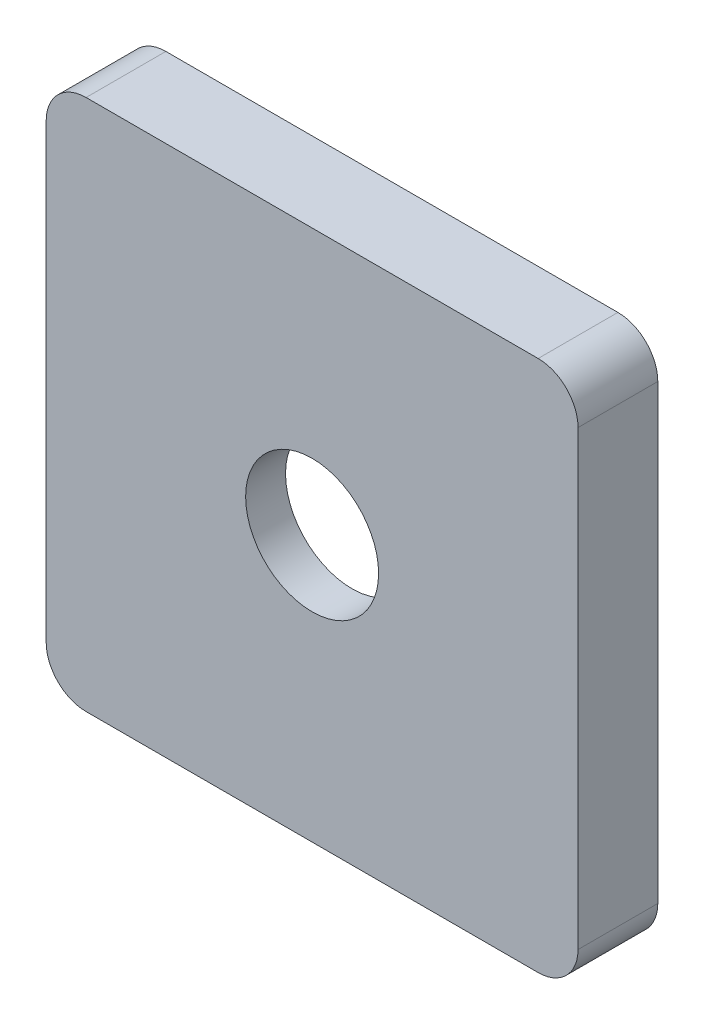
ISO-10303-21;
HEADER;
FILE_DESCRIPTION(('STEP AP214'),'2;1');
FILE_NAME('part.step','',(''),(''),'','','');
FILE_SCHEMA(('AUTOMOTIVE_DESIGN { 1 0 10303 214 1 1 1 1 }'));
ENDSEC;
DATA;
#1=APPLICATION_CONTEXT('core data for automotive mechanical design processes');
#2=APPLICATION_PROTOCOL_DEFINITION('international standard','automotive_design',2000,#1);
#3=PRODUCT_CONTEXT('',#1,'mechanical');
#4=PRODUCT('Part','Part','',(#3));
#5=PRODUCT_RELATED_PRODUCT_CATEGORY('part','',(#4));
#6=PRODUCT_DEFINITION_FORMATION('','',#4);
#7=PRODUCT_DEFINITION_CONTEXT('part definition',#1,'design');
#8=PRODUCT_DEFINITION('design','',#6,#7);
#9=PRODUCT_DEFINITION_SHAPE('','',#8);
#10=(LENGTH_UNIT() NAMED_UNIT(*) SI_UNIT(.MILLI.,.METRE.));
#11=(NAMED_UNIT(*) PLANE_ANGLE_UNIT() SI_UNIT($,.RADIAN.));
#12=(NAMED_UNIT(*) SI_UNIT($,.STERADIAN.) SOLID_ANGLE_UNIT());
#13=UNCERTAINTY_MEASURE_WITH_UNIT(LENGTH_MEASURE(1.E-05),#10,'distance_accuracy_value','');
#14=(GEOMETRIC_REPRESENTATION_CONTEXT(3) GLOBAL_UNCERTAINTY_ASSIGNED_CONTEXT((#13)) GLOBAL_UNIT_ASSIGNED_CONTEXT((#10,
#11,#12)) REPRESENTATION_CONTEXT('',''));
#15=CARTESIAN_POINT('',(0.,0.,0.));
#16=DIRECTION('',(0.,0.,1.));
#17=DIRECTION('',(1.,0.,0.));
#18=AXIS2_PLACEMENT_3D('',#15,#16,#17);
#19=CARTESIAN_POINT('',(0.,0.,1.5));
#20=DIRECTION('',(0.,0.,-1.));
#21=DIRECTION('',(-1.,0.,0.));
#22=AXIS2_PLACEMENT_3D('',#19,#20,#21);
#23=CYLINDRICAL_SURFACE('',#22,2.5);
#24=CARTESIAN_POINT('',(0.,0.,1.5));
#25=DIRECTION('',(0.,0.,1.));
#26=DIRECTION('',(1.,0.,0.));
#27=AXIS2_PLACEMENT_3D('',#24,#25,#26);
#28=CIRCLE('',#27,2.5);
#29=CARTESIAN_POINT('',(2.5,0.,1.5));
#30=VERTEX_POINT('',#29);
#31=EDGE_CURVE('E136',#30,#30,#28,.T.);
#32=ORIENTED_EDGE('',*,*,#31,.T.);
#33=EDGE_LOOP('',(#32));
#34=FACE_BOUND('',#33,.T.);
#35=CARTESIAN_POINT('',(0.,0.,0.));
#36=DIRECTION('',(0.,0.,-1.));
#37=DIRECTION('',(-1.,0.,0.));
#38=AXIS2_PLACEMENT_3D('',#35,#36,#37);
#39=CIRCLE('',#38,2.5);
#40=CARTESIAN_POINT('',(-2.5,0.,0.));
#41=VERTEX_POINT('',#40);
#42=EDGE_CURVE('E37',#41,#41,#39,.T.);
#43=ORIENTED_EDGE('',*,*,#42,.T.);
#44=EDGE_LOOP('',(#43));
#45=FACE_BOUND('',#44,.T.);
#46=ADVANCED_FACE('F33',(#34,#45),#23,.F.);
#47=CARTESIAN_POINT('',(-8.5,-8.5,1.5));
#48=DIRECTION('',(0.,0.,1.));
#49=DIRECTION('',(1.,0.,0.));
#50=AXIS2_PLACEMENT_3D('',#47,#48,#49);
#51=PLANE('',#50);
#52=CARTESIAN_POINT('',(-8.5,-8.5,1.5));
#53=DIRECTION('',(0.,0.,1.));
#54=DIRECTION('',(1.,0.,0.));
#55=AXIS2_PLACEMENT_3D('',#52,#53,#54);
#56=CIRCLE('',#55,1.5);
#57=CARTESIAN_POINT('',(-10.,-8.49999999999999,1.5));
#58=VERTEX_POINT('',#57);
#59=CARTESIAN_POINT('',(-8.49999999999999,-10.,1.5));
#60=VERTEX_POINT('',#59);
#61=EDGE_CURVE('E147',#58,#60,#56,.T.);
#62=ORIENTED_EDGE('',*,*,#61,.T.);
#63=DIRECTION('',(1.,0.,0.));
#64=VECTOR('',#63,1.);
#65=CARTESIAN_POINT('',(-8.49999999999999,-10.,1.5));
#66=LINE('',#65,#64);
#67=CARTESIAN_POINT('',(8.49999999999999,-10.,1.5));
#68=VERTEX_POINT('',#67);
#69=EDGE_CURVE('E94',#60,#68,#66,.T.);
#70=ORIENTED_EDGE('',*,*,#69,.T.);
#71=CARTESIAN_POINT('',(8.5,-8.5,1.5));
#72=DIRECTION('',(0.,0.,1.));
#73=DIRECTION('',(1.,0.,0.));
#74=AXIS2_PLACEMENT_3D('',#71,#72,#73);
#75=CIRCLE('',#74,1.5);
#76=CARTESIAN_POINT('',(10.,-8.49999999999999,1.5));
#77=VERTEX_POINT('',#76);
#78=EDGE_CURVE('E163',#68,#77,#75,.T.);
#79=ORIENTED_EDGE('',*,*,#78,.T.);
#80=DIRECTION('',(0.,1.,0.));
#81=VECTOR('',#80,1.);
#82=CARTESIAN_POINT('',(10.,8.49999999999999,1.5));
#83=LINE('',#82,#81);
#84=CARTESIAN_POINT('',(10.,8.49999999999999,1.5));
#85=VERTEX_POINT('',#84);
#86=EDGE_CURVE('E175',#77,#85,#83,.T.);
#87=ORIENTED_EDGE('',*,*,#86,.T.);
#88=CARTESIAN_POINT('',(8.5,8.5,1.5));
#89=DIRECTION('',(0.,0.,1.));
#90=DIRECTION('',(-1.,0.,0.));
#91=AXIS2_PLACEMENT_3D('',#88,#89,#90);
#92=CIRCLE('',#91,1.5);
#93=CARTESIAN_POINT('',(8.49999999999999,10.,1.5));
#94=VERTEX_POINT('',#93);
#95=EDGE_CURVE('E114',#85,#94,#92,.T.);
#96=ORIENTED_EDGE('',*,*,#95,.T.);
#97=DIRECTION('',(-1.,0.,0.));
#98=VECTOR('',#97,1.);
#99=CARTESIAN_POINT('',(-8.49999999999999,10.,1.5));
#100=LINE('',#99,#98);
#101=CARTESIAN_POINT('',(-8.49999999999999,10.,1.5));
#102=VERTEX_POINT('',#101);
#103=EDGE_CURVE('E107',#94,#102,#100,.T.);
#104=ORIENTED_EDGE('',*,*,#103,.T.);
#105=CARTESIAN_POINT('',(-8.5,8.5,1.5));
#106=DIRECTION('',(0.,0.,1.));
#107=DIRECTION('',(1.,0.,0.));
#108=AXIS2_PLACEMENT_3D('',#105,#106,#107);
#109=CIRCLE('',#108,1.5);
#110=CARTESIAN_POINT('',(-10.,8.49999999999999,1.5));
#111=VERTEX_POINT('',#110);
#112=EDGE_CURVE('E112',#102,#111,#109,.T.);
#113=ORIENTED_EDGE('',*,*,#112,.T.);
#114=DIRECTION('',(0.,-1.,0.));
#115=VECTOR('',#114,1.);
#116=CARTESIAN_POINT('',(-10.,8.49999999999999,1.5));
#117=LINE('',#116,#115);
#118=EDGE_CURVE('E51',#111,#58,#117,.T.);
#119=ORIENTED_EDGE('',*,*,#118,.T.);
#120=EDGE_LOOP('',(#62,#70,#79,#87,#96,#104,#113,#119));
#121=FACE_BOUND('',#120,.T.);
#122=ORIENTED_EDGE('',*,*,#31,.F.);
#123=EDGE_LOOP('',(#122));
#124=FACE_BOUND('',#123,.T.);
#125=ADVANCED_FACE('F109',(#121,#124),#51,.T.);
#126=CARTESIAN_POINT('',(-8.5,-8.5,-1.5));
#127=DIRECTION('',(0.,0.,1.));
#128=DIRECTION('',(1.,0.,0.));
#129=AXIS2_PLACEMENT_3D('',#126,#127,#128);
#130=PLANE('',#129);
#131=CARTESIAN_POINT('',(0.,0.,-1.5));
#132=DIRECTION('',(0.,0.,-1.));
#133=DIRECTION('',(-1.,0.,0.));
#134=AXIS2_PLACEMENT_3D('',#131,#132,#133);
#135=CIRCLE('',#134,5.);
#136=CARTESIAN_POINT('',(-5.,0.,-1.5));
#137=VERTEX_POINT('',#136);
#138=EDGE_CURVE('E183',#137,#137,#135,.T.);
#139=ORIENTED_EDGE('',*,*,#138,.F.);
#140=EDGE_LOOP('',(#139));
#141=FACE_BOUND('',#140,.T.);
#142=CARTESIAN_POINT('',(-8.5,-8.5,-1.5));
#143=DIRECTION('',(0.,0.,1.));
#144=DIRECTION('',(1.,0.,0.));
#145=AXIS2_PLACEMENT_3D('',#142,#143,#144);
#146=CIRCLE('',#145,1.5);
#147=CARTESIAN_POINT('',(-10.,-8.49999999999999,-1.5));
#148=VERTEX_POINT('',#147);
#149=CARTESIAN_POINT('',(-8.49999999999999,-10.,-1.5));
#150=VERTEX_POINT('',#149);
#151=EDGE_CURVE('E132',#148,#150,#146,.T.);
#152=ORIENTED_EDGE('',*,*,#151,.F.);
#153=DIRECTION('',(0.,-1.,0.));
#154=VECTOR('',#153,1.);
#155=CARTESIAN_POINT('',(-10.,8.49999999999999,-1.5));
#156=LINE('',#155,#154);
#157=CARTESIAN_POINT('',(-10.,8.49999999999999,-1.5));
#158=VERTEX_POINT('',#157);
#159=EDGE_CURVE('E86',#158,#148,#156,.T.);
#160=ORIENTED_EDGE('',*,*,#159,.F.);
#161=CARTESIAN_POINT('',(-8.5,8.5,-1.5));
#162=DIRECTION('',(0.,0.,1.));
#163=DIRECTION('',(1.,0.,0.));
#164=AXIS2_PLACEMENT_3D('',#161,#162,#163);
#165=CIRCLE('',#164,1.5);
#166=CARTESIAN_POINT('',(-8.49999999999999,10.,-1.5));
#167=VERTEX_POINT('',#166);
#168=EDGE_CURVE('E80',#167,#158,#165,.T.);
#169=ORIENTED_EDGE('',*,*,#168,.F.);
#170=DIRECTION('',(-1.,0.,0.));
#171=VECTOR('',#170,1.);
#172=CARTESIAN_POINT('',(-8.49999999999999,10.,-1.5));
#173=LINE('',#172,#171);
#174=CARTESIAN_POINT('',(8.49999999999999,10.,-1.5));
#175=VERTEX_POINT('',#174);
#176=EDGE_CURVE('E122',#175,#167,#173,.T.);
#177=ORIENTED_EDGE('',*,*,#176,.F.);
#178=CARTESIAN_POINT('',(8.5,8.5,-1.5));
#179=DIRECTION('',(0.,0.,1.));
#180=DIRECTION('',(-1.,0.,0.));
#181=AXIS2_PLACEMENT_3D('',#178,#179,#180);
#182=CIRCLE('',#181,1.5);
#183=CARTESIAN_POINT('',(10.,8.49999999999999,-1.5));
#184=VERTEX_POINT('',#183);
#185=EDGE_CURVE('E142',#184,#175,#182,.T.);
#186=ORIENTED_EDGE('',*,*,#185,.F.);
#187=DIRECTION('',(0.,1.,0.));
#188=VECTOR('',#187,1.);
#189=CARTESIAN_POINT('',(10.,8.49999999999999,-1.5));
#190=LINE('',#189,#188);
#191=CARTESIAN_POINT('',(10.,-8.49999999999999,-1.5));
#192=VERTEX_POINT('',#191);
#193=EDGE_CURVE('E140',#192,#184,#190,.T.);
#194=ORIENTED_EDGE('',*,*,#193,.F.);
#195=CARTESIAN_POINT('',(8.5,-8.5,-1.5));
#196=DIRECTION('',(0.,0.,1.));
#197=DIRECTION('',(1.,0.,0.));
#198=AXIS2_PLACEMENT_3D('',#195,#196,#197);
#199=CIRCLE('',#198,1.5);
#200=CARTESIAN_POINT('',(8.49999999999999,-10.,-1.5));
#201=VERTEX_POINT('',#200);
#202=EDGE_CURVE('E138',#201,#192,#199,.T.);
#203=ORIENTED_EDGE('',*,*,#202,.F.);
#204=DIRECTION('',(1.,0.,0.));
#205=VECTOR('',#204,1.);
#206=CARTESIAN_POINT('',(-8.49999999999999,-10.,-1.5));
#207=LINE('',#206,#205);
#208=EDGE_CURVE('E135',#150,#201,#207,.T.);
#209=ORIENTED_EDGE('',*,*,#208,.F.);
#210=EDGE_LOOP('',(#152,#160,#169,#177,#186,#194,#203,#209));
#211=FACE_BOUND('',#210,.T.);
#212=ADVANCED_FACE('F167',(#141,#211),#130,.F.);
#213=CARTESIAN_POINT('',(-8.5,-8.5,1.5));
#214=DIRECTION('',(0.,0.,-1.));
#215=DIRECTION('',(-1.,0.,0.));
#216=AXIS2_PLACEMENT_3D('',#213,#214,#215);
#217=CYLINDRICAL_SURFACE('',#216,1.5);
#218=ORIENTED_EDGE('',*,*,#151,.T.);
#219=DIRECTION('',(0.,0.,-1.));
#220=VECTOR('',#219,1.);
#221=CARTESIAN_POINT('',(-8.49999999999999,-10.,1.5));
#222=LINE('',#221,#220);
#223=EDGE_CURVE('E11',#60,#150,#222,.T.);
#224=ORIENTED_EDGE('',*,*,#223,.F.);
#225=ORIENTED_EDGE('',*,*,#61,.F.);
#226=DIRECTION('',(0.,0.,-1.));
#227=VECTOR('',#226,1.);
#228=CARTESIAN_POINT('',(-10.,-8.49999999999999,1.5));
#229=LINE('',#228,#227);
#230=EDGE_CURVE('E128',#58,#148,#229,.T.);
#231=ORIENTED_EDGE('',*,*,#230,.T.);
#232=EDGE_LOOP('',(#218,#224,#225,#231));
#233=FACE_BOUND('',#232,.T.);
#234=ADVANCED_FACE('F35',(#233),#217,.T.);
#235=CARTESIAN_POINT('',(-8.49999999999999,-10.,1.5));
#236=DIRECTION('',(0.,1.,0.));
#237=DIRECTION('',(0.,0.,1.));
#238=AXIS2_PLACEMENT_3D('',#235,#236,#237);
#239=PLANE('',#238);
#240=ORIENTED_EDGE('',*,*,#208,.T.);
#241=DIRECTION('',(0.,0.,-1.));
#242=VECTOR('',#241,1.);
#243=CARTESIAN_POINT('',(8.49999999999999,-10.,1.5));
#244=LINE('',#243,#242);
#245=EDGE_CURVE('E43',#68,#201,#244,.T.);
#246=ORIENTED_EDGE('',*,*,#245,.F.);
#247=ORIENTED_EDGE('',*,*,#69,.F.);
#248=ORIENTED_EDGE('',*,*,#223,.T.);
#249=EDGE_LOOP('',(#240,#246,#247,#248));
#250=FACE_BOUND('',#249,.T.);
#251=ADVANCED_FACE('F226',(#250),#239,.F.);
#252=CARTESIAN_POINT('',(8.5,-8.5,1.5));
#253=DIRECTION('',(0.,0.,-1.));
#254=DIRECTION('',(-1.,0.,0.));
#255=AXIS2_PLACEMENT_3D('',#252,#253,#254);
#256=CYLINDRICAL_SURFACE('',#255,1.5);
#257=ORIENTED_EDGE('',*,*,#202,.T.);
#258=DIRECTION('',(0.,0.,-1.));
#259=VECTOR('',#258,1.);
#260=CARTESIAN_POINT('',(10.,-8.49999999999999,1.5));
#261=LINE('',#260,#259);
#262=EDGE_CURVE('E154',#77,#192,#261,.T.);
#263=ORIENTED_EDGE('',*,*,#262,.F.);
#264=ORIENTED_EDGE('',*,*,#78,.F.);
#265=ORIENTED_EDGE('',*,*,#245,.T.);
#266=EDGE_LOOP('',(#257,#263,#264,#265));
#267=FACE_BOUND('',#266,.T.);
#268=ADVANCED_FACE('F161',(#267),#256,.T.);
#269=CARTESIAN_POINT('',(10.,8.49999999999999,1.5));
#270=DIRECTION('',(-1.,0.,0.));
#271=DIRECTION('',(0.,-1.,0.));
#272=AXIS2_PLACEMENT_3D('',#269,#270,#271);
#273=PLANE('',#272);
#274=ORIENTED_EDGE('',*,*,#193,.T.);
#275=DIRECTION('',(0.,0.,-1.));
#276=VECTOR('',#275,1.);
#277=CARTESIAN_POINT('',(10.,8.49999999999999,1.5));
#278=LINE('',#277,#276);
#279=EDGE_CURVE('E151',#85,#184,#278,.T.);
#280=ORIENTED_EDGE('',*,*,#279,.F.);
#281=ORIENTED_EDGE('',*,*,#86,.F.);
#282=ORIENTED_EDGE('',*,*,#262,.T.);
#283=EDGE_LOOP('',(#274,#280,#281,#282));
#284=FACE_BOUND('',#283,.T.);
#285=ADVANCED_FACE('F171',(#284),#273,.F.);
#286=CARTESIAN_POINT('',(8.5,8.5,1.5));
#287=DIRECTION('',(0.,0.,-1.));
#288=DIRECTION('',(-1.,0.,0.));
#289=AXIS2_PLACEMENT_3D('',#286,#287,#288);
#290=CYLINDRICAL_SURFACE('',#289,1.5);
#291=ORIENTED_EDGE('',*,*,#185,.T.);
#292=DIRECTION('',(0.,0.,-1.));
#293=VECTOR('',#292,1.);
#294=CARTESIAN_POINT('',(8.49999999999999,10.,1.5));
#295=LINE('',#294,#293);
#296=EDGE_CURVE('E123',#94,#175,#295,.T.);
#297=ORIENTED_EDGE('',*,*,#296,.F.);
#298=ORIENTED_EDGE('',*,*,#95,.F.);
#299=ORIENTED_EDGE('',*,*,#279,.T.);
#300=EDGE_LOOP('',(#291,#297,#298,#299));
#301=FACE_BOUND('',#300,.T.);
#302=ADVANCED_FACE('F174',(#301),#290,.T.);
#303=CARTESIAN_POINT('',(-8.49999999999999,10.,1.5));
#304=DIRECTION('',(0.,-1.,0.));
#305=DIRECTION('',(0.,0.,-1.));
#306=AXIS2_PLACEMENT_3D('',#303,#304,#305);
#307=PLANE('',#306);
#308=ORIENTED_EDGE('',*,*,#176,.T.);
#309=DIRECTION('',(0.,0.,-1.));
#310=VECTOR('',#309,1.);
#311=CARTESIAN_POINT('',(-8.49999999999999,10.,1.5));
#312=LINE('',#311,#310);
#313=EDGE_CURVE('E119',#102,#167,#312,.T.);
#314=ORIENTED_EDGE('',*,*,#313,.F.);
#315=ORIENTED_EDGE('',*,*,#103,.F.);
#316=ORIENTED_EDGE('',*,*,#296,.T.);
#317=EDGE_LOOP('',(#308,#314,#315,#316));
#318=FACE_BOUND('',#317,.T.);
#319=ADVANCED_FACE('F120',(#318),#307,.F.);
#320=CARTESIAN_POINT('',(-8.5,8.5,1.5));
#321=DIRECTION('',(0.,0.,-1.));
#322=DIRECTION('',(-1.,0.,0.));
#323=AXIS2_PLACEMENT_3D('',#320,#321,#322);
#324=CYLINDRICAL_SURFACE('',#323,1.5);
#325=ORIENTED_EDGE('',*,*,#168,.T.);
#326=DIRECTION('',(0.,0.,-1.));
#327=VECTOR('',#326,1.);
#328=CARTESIAN_POINT('',(-10.,8.49999999999999,1.5));
#329=LINE('',#328,#327);
#330=EDGE_CURVE('E124',#111,#158,#329,.T.);
#331=ORIENTED_EDGE('',*,*,#330,.F.);
#332=ORIENTED_EDGE('',*,*,#112,.F.);
#333=ORIENTED_EDGE('',*,*,#313,.T.);
#334=EDGE_LOOP('',(#325,#331,#332,#333));
#335=FACE_BOUND('',#334,.T.);
#336=ADVANCED_FACE('F126',(#335),#324,.T.);
#337=CARTESIAN_POINT('',(-10.,8.49999999999999,1.5));
#338=DIRECTION('',(1.,0.,0.));
#339=DIRECTION('',(0.,0.,-1.));
#340=AXIS2_PLACEMENT_3D('',#337,#338,#339);
#341=PLANE('',#340);
#342=ORIENTED_EDGE('',*,*,#159,.T.);
#343=ORIENTED_EDGE('',*,*,#230,.F.);
#344=ORIENTED_EDGE('',*,*,#118,.F.);
#345=ORIENTED_EDGE('',*,*,#330,.T.);
#346=EDGE_LOOP('',(#342,#343,#344,#345));
#347=FACE_BOUND('',#346,.T.);
#348=ADVANCED_FACE('F201',(#347),#341,.F.);
#349=CARTESIAN_POINT('',(0.,0.,0.));
#350=DIRECTION('',(0.,0.,-1.));
#351=DIRECTION('',(-1.,0.,0.));
#352=AXIS2_PLACEMENT_3D('',#349,#350,#351);
#353=CYLINDRICAL_SURFACE('',#352,5.);
#354=CARTESIAN_POINT('',(0.,0.,0.));
#355=DIRECTION('',(0.,0.,-1.));
#356=DIRECTION('',(-1.,0.,0.));
#357=AXIS2_PLACEMENT_3D('',#354,#355,#356);
#358=CIRCLE('',#357,5.);
#359=CARTESIAN_POINT('',(-5.,0.,0.));
#360=VERTEX_POINT('',#359);
#361=EDGE_CURVE('E186',#360,#360,#358,.T.);
#362=ORIENTED_EDGE('',*,*,#361,.F.);
#363=EDGE_LOOP('',(#362));
#364=FACE_BOUND('',#363,.T.);
#365=ORIENTED_EDGE('',*,*,#138,.T.);
#366=EDGE_LOOP('',(#365));
#367=FACE_BOUND('',#366,.T.);
#368=ADVANCED_FACE('F196',(#364,#367),#353,.F.);
#369=CARTESIAN_POINT('',(0.,0.,0.));
#370=DIRECTION('',(0.,0.,-1.));
#371=DIRECTION('',(-1.,0.,0.));
#372=AXIS2_PLACEMENT_3D('',#369,#370,#371);
#373=PLANE('',#372);
#374=ORIENTED_EDGE('',*,*,#42,.F.);
#375=EDGE_LOOP('',(#374));
#376=FACE_BOUND('',#375,.T.);
#377=ORIENTED_EDGE('',*,*,#361,.T.);
#378=EDGE_LOOP('',(#377));
#379=FACE_BOUND('',#378,.T.);
#380=ADVANCED_FACE('F194',(#376,#379),#373,.T.);
#381=CLOSED_SHELL('',(#46,#125,#212,#234,#251,#268,#285,#302,#319,#336,#348,#368,#380));
#382=MANIFOLD_SOLID_BREP('B2',#381);
#383=ADVANCED_BREP_SHAPE_REPRESENTATION('',(#18,#382),#14);
#384=SHAPE_DEFINITION_REPRESENTATION(#9,#383);
ENDSEC;
END-ISO-10303-21;
